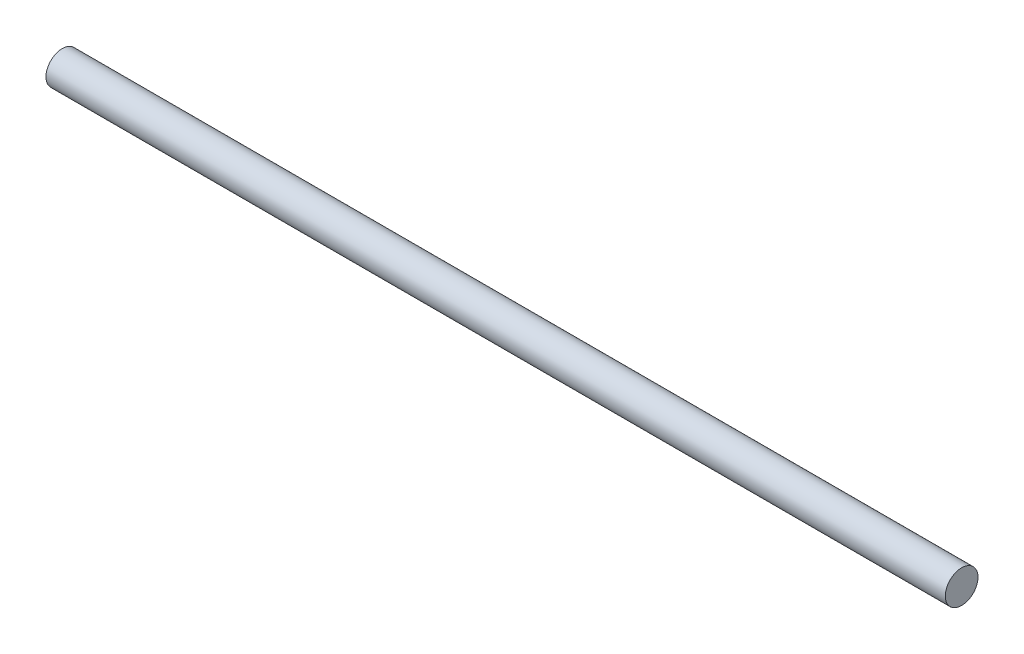
ISO-10303-21;
HEADER;
FILE_DESCRIPTION(('STEP AP214'),'2;1');
FILE_NAME('part.step','',(''),(''),'','','');
FILE_SCHEMA(('AUTOMOTIVE_DESIGN { 1 0 10303 214 1 1 1 1 }'));
ENDSEC;
DATA;
#1=APPLICATION_CONTEXT('core data for automotive mechanical design processes');
#2=APPLICATION_PROTOCOL_DEFINITION('international standard','automotive_design',2000,#1);
#3=PRODUCT_CONTEXT('',#1,'mechanical');
#4=PRODUCT('Part','Part','',(#3));
#5=PRODUCT_RELATED_PRODUCT_CATEGORY('part','',(#4));
#6=PRODUCT_DEFINITION_FORMATION('','',#4);
#7=PRODUCT_DEFINITION_CONTEXT('part definition',#1,'design');
#8=PRODUCT_DEFINITION('design','',#6,#7);
#9=PRODUCT_DEFINITION_SHAPE('','',#8);
#10=(LENGTH_UNIT() NAMED_UNIT(*) SI_UNIT(.MILLI.,.METRE.));
#11=(NAMED_UNIT(*) PLANE_ANGLE_UNIT() SI_UNIT($,.RADIAN.));
#12=(NAMED_UNIT(*) SI_UNIT($,.STERADIAN.) SOLID_ANGLE_UNIT());
#13=UNCERTAINTY_MEASURE_WITH_UNIT(LENGTH_MEASURE(1.E-05),#10,'distance_accuracy_value','');
#14=(GEOMETRIC_REPRESENTATION_CONTEXT(3) GLOBAL_UNCERTAINTY_ASSIGNED_CONTEXT((#13)) GLOBAL_UNIT_ASSIGNED_CONTEXT((#10,
#11,#12)) REPRESENTATION_CONTEXT('',''));
#15=CARTESIAN_POINT('',(0.,0.,0.));
#16=DIRECTION('',(0.,0.,1.));
#17=DIRECTION('',(1.,0.,0.));
#18=AXIS2_PLACEMENT_3D('',#15,#16,#17);
#19=CARTESIAN_POINT('',(220.,0.,0.));
#20=DIRECTION('',(-1.,0.,0.));
#21=DIRECTION('',(0.,0.,1.));
#22=AXIS2_PLACEMENT_3D('',#19,#20,#21);
#23=CYLINDRICAL_SURFACE('',#22,4.);
#24=CARTESIAN_POINT('',(220.,0.,0.));
#25=DIRECTION('',(1.,0.,0.));
#26=DIRECTION('',(0.,0.,-1.));
#27=AXIS2_PLACEMENT_3D('',#24,#25,#26);
#28=CIRCLE('',#27,4.);
#29=CARTESIAN_POINT('',(220.,0.,-4.));
#30=VERTEX_POINT('',#29);
#31=EDGE_CURVE('E10',#30,#30,#28,.T.);
#32=ORIENTED_EDGE('',*,*,#31,.F.);
#33=EDGE_LOOP('',(#32));
#34=FACE_BOUND('',#33,.T.);
#35=CARTESIAN_POINT('',(0.,0.,0.));
#36=DIRECTION('',(1.,0.,0.));
#37=DIRECTION('',(0.,0.,-1.));
#38=AXIS2_PLACEMENT_3D('',#35,#36,#37);
#39=CIRCLE('',#38,4.);
#40=CARTESIAN_POINT('',(0.,0.,-4.));
#41=VERTEX_POINT('',#40);
#42=EDGE_CURVE('E40',#41,#41,#39,.T.);
#43=ORIENTED_EDGE('',*,*,#42,.T.);
#44=EDGE_LOOP('',(#43));
#45=FACE_BOUND('',#44,.T.);
#46=ADVANCED_FACE('F37',(#34,#45),#23,.T.);
#47=CARTESIAN_POINT('',(220.,0.,0.));
#48=DIRECTION('',(1.,0.,0.));
#49=DIRECTION('',(0.,0.,-1.));
#50=AXIS2_PLACEMENT_3D('',#47,#48,#49);
#51=PLANE('',#50);
#52=ORIENTED_EDGE('',*,*,#31,.T.);
#53=EDGE_LOOP('',(#52));
#54=FACE_BOUND('',#53,.T.);
#55=ADVANCED_FACE('F52',(#54),#51,.T.);
#56=CARTESIAN_POINT('',(0.,0.,0.));
#57=DIRECTION('',(1.,0.,0.));
#58=DIRECTION('',(0.,0.,-1.));
#59=AXIS2_PLACEMENT_3D('',#56,#57,#58);
#60=PLANE('',#59);
#61=ORIENTED_EDGE('',*,*,#42,.F.);
#62=EDGE_LOOP('',(#61));
#63=FACE_BOUND('',#62,.T.);
#64=ADVANCED_FACE('F50',(#63),#60,.F.);
#65=CLOSED_SHELL('',(#46,#55,#64));
#66=MANIFOLD_SOLID_BREP('B2',#65);
#67=ADVANCED_BREP_SHAPE_REPRESENTATION('',(#18,#66),#14);
#68=SHAPE_DEFINITION_REPRESENTATION(#9,#67);
ENDSEC;
END-ISO-10303-21;
